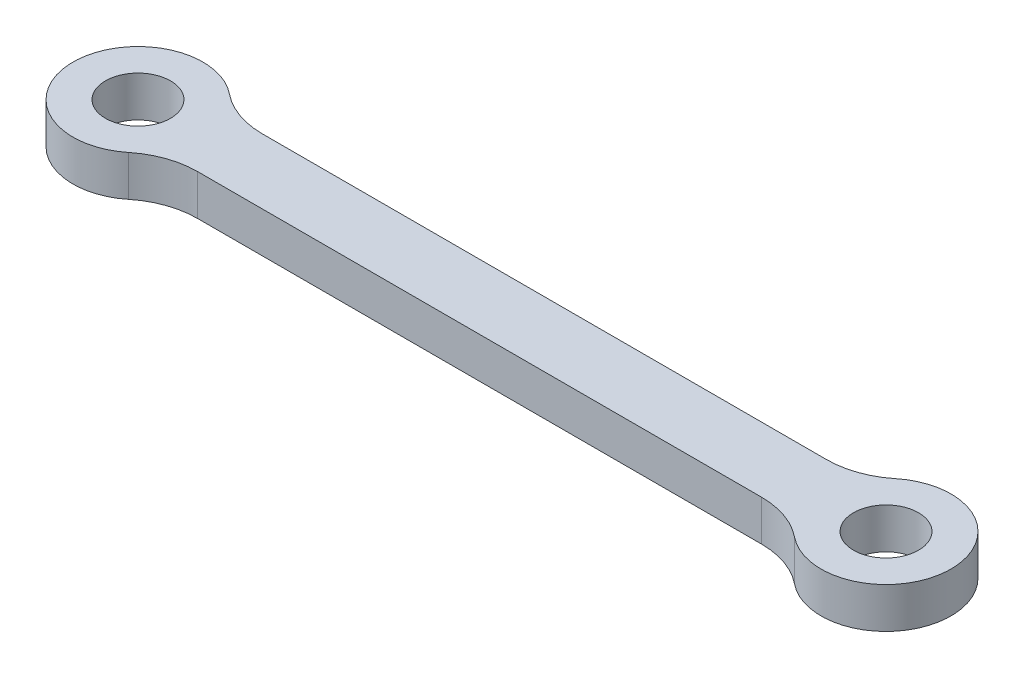
ISO-10303-21;
HEADER;
FILE_DESCRIPTION(('STEP AP214'),'2;1');
FILE_NAME('part.step','',(''),(''),'','','');
FILE_SCHEMA(('AUTOMOTIVE_DESIGN { 1 0 10303 214 1 1 1 1 }'));
ENDSEC;
DATA;
#1=APPLICATION_CONTEXT('core data for automotive mechanical design processes');
#2=APPLICATION_PROTOCOL_DEFINITION('international standard','automotive_design',2000,#1);
#3=PRODUCT_CONTEXT('',#1,'mechanical');
#4=PRODUCT('Part','Part','',(#3));
#5=PRODUCT_RELATED_PRODUCT_CATEGORY('part','',(#4));
#6=PRODUCT_DEFINITION_FORMATION('','',#4);
#7=PRODUCT_DEFINITION_CONTEXT('part definition',#1,'design');
#8=PRODUCT_DEFINITION('design','',#6,#7);
#9=PRODUCT_DEFINITION_SHAPE('','',#8);
#10=(LENGTH_UNIT() NAMED_UNIT(*) SI_UNIT(.MILLI.,.METRE.));
#11=(NAMED_UNIT(*) PLANE_ANGLE_UNIT() SI_UNIT($,.RADIAN.));
#12=(NAMED_UNIT(*) SI_UNIT($,.STERADIAN.) SOLID_ANGLE_UNIT());
#13=UNCERTAINTY_MEASURE_WITH_UNIT(LENGTH_MEASURE(1.E-05),#10,'distance_accuracy_value','');
#14=(GEOMETRIC_REPRESENTATION_CONTEXT(3) GLOBAL_UNCERTAINTY_ASSIGNED_CONTEXT((#13)) GLOBAL_UNIT_ASSIGNED_CONTEXT((#10,
#11,#12)) REPRESENTATION_CONTEXT('',''));
#15=CARTESIAN_POINT('',(0.,0.,0.));
#16=DIRECTION('',(0.,0.,1.));
#17=DIRECTION('',(1.,0.,0.));
#18=AXIS2_PLACEMENT_3D('',#15,#16,#17);
#19=CARTESIAN_POINT('',(-23.,3.75,0.));
#20=DIRECTION('',(0.,1.,0.));
#21=DIRECTION('',(0.,0.,1.));
#22=AXIS2_PLACEMENT_3D('',#19,#20,#21);
#23=PLANE('',#22);
#24=CARTESIAN_POINT('',(-23.,3.75,0.));
#25=DIRECTION('',(0.,1.,0.));
#26=DIRECTION('',(0.,0.,1.));
#27=AXIS2_PLACEMENT_3D('',#24,#25,#26);
#28=CIRCLE('',#27,2.);
#29=CARTESIAN_POINT('',(-23.,3.75,2.));
#30=VERTEX_POINT('',#29);
#31=EDGE_CURVE('E162',#30,#30,#28,.T.);
#32=ORIENTED_EDGE('',*,*,#31,.F.);
#33=EDGE_LOOP('',(#32));
#34=FACE_BOUND('',#33,.T.);
#35=DIRECTION('',(-1.,0.,0.));
#36=VECTOR('',#35,1.);
#37=CARTESIAN_POINT('',(19.5358983848622,3.75,-2.));
#38=LINE('',#37,#36);
#39=CARTESIAN_POINT('',(17.3431457505076,3.75,-2.));
#40=VERTEX_POINT('',#39);
#41=CARTESIAN_POINT('',(-17.3431457505076,3.75,-2.));
#42=VERTEX_POINT('',#41);
#43=EDGE_CURVE('E139',#40,#42,#38,.T.);
#44=ORIENTED_EDGE('',*,*,#43,.T.);
#45=CARTESIAN_POINT('',(-17.3431457505076,3.75,-7.));
#46=DIRECTION('',(0.,1.,0.));
#47=DIRECTION('',(0.,0.,1.));
#48=AXIS2_PLACEMENT_3D('',#45,#46,#47);
#49=CIRCLE('',#48,5.);
#50=CARTESIAN_POINT('',(-20.4858425557812,3.75,-3.11111111111111));
#51=VERTEX_POINT('',#50);
#52=EDGE_CURVE('E56',#42,#51,#49,.F.);
#53=ORIENTED_EDGE('',*,*,#52,.T.);
#54=CARTESIAN_POINT('',(-23.,3.75,0.));
#55=DIRECTION('',(0.,1.,0.));
#56=DIRECTION('',(0.,0.,1.));
#57=AXIS2_PLACEMENT_3D('',#54,#55,#56);
#58=CIRCLE('',#57,4.);
#59=CARTESIAN_POINT('',(-20.4858425557812,3.75,3.11111111111111));
#60=VERTEX_POINT('',#59);
#61=EDGE_CURVE('E133',#51,#60,#58,.T.);
#62=ORIENTED_EDGE('',*,*,#61,.T.);
#63=CARTESIAN_POINT('',(-17.3431457505076,3.75,7.));
#64=DIRECTION('',(0.,1.,0.));
#65=DIRECTION('',(0.,0.,1.));
#66=AXIS2_PLACEMENT_3D('',#63,#64,#65);
#67=CIRCLE('',#66,5.);
#68=CARTESIAN_POINT('',(-17.3431457505076,3.75,2.));
#69=VERTEX_POINT('',#68);
#70=EDGE_CURVE('E11',#60,#69,#67,.F.);
#71=ORIENTED_EDGE('',*,*,#70,.T.);
#72=DIRECTION('',(1.,0.,0.));
#73=VECTOR('',#72,1.);
#74=CARTESIAN_POINT('',(19.5358983848622,3.75,1.99999999999999));
#75=LINE('',#74,#73);
#76=CARTESIAN_POINT('',(17.3431457505076,3.75,1.99999999999999));
#77=VERTEX_POINT('',#76);
#78=EDGE_CURVE('E167',#69,#77,#75,.T.);
#79=ORIENTED_EDGE('',*,*,#78,.T.);
#80=CARTESIAN_POINT('',(17.3431457505076,3.75,6.99999999999999));
#81=DIRECTION('',(0.,1.,0.));
#82=DIRECTION('',(0.,0.,1.));
#83=AXIS2_PLACEMENT_3D('',#80,#81,#82);
#84=CIRCLE('',#83,5.);
#85=CARTESIAN_POINT('',(20.4858425557811,3.75,3.11111111111111));
#86=VERTEX_POINT('',#85);
#87=EDGE_CURVE('E110',#77,#86,#84,.F.);
#88=ORIENTED_EDGE('',*,*,#87,.T.);
#89=CARTESIAN_POINT('',(23.,3.75,0.));
#90=DIRECTION('',(0.,1.,0.));
#91=DIRECTION('',(0.,0.,-1.));
#92=AXIS2_PLACEMENT_3D('',#89,#90,#91);
#93=CIRCLE('',#92,4.);
#94=CARTESIAN_POINT('',(20.4858425557812,3.75,-3.11111111111111));
#95=VERTEX_POINT('',#94);
#96=EDGE_CURVE('E120',#86,#95,#93,.T.);
#97=ORIENTED_EDGE('',*,*,#96,.T.);
#98=CARTESIAN_POINT('',(17.3431457505076,3.75,-7.));
#99=DIRECTION('',(0.,1.,0.));
#100=DIRECTION('',(0.,0.,1.));
#101=AXIS2_PLACEMENT_3D('',#98,#99,#100);
#102=CIRCLE('',#101,5.);
#103=EDGE_CURVE('E154',#95,#40,#102,.F.);
#104=ORIENTED_EDGE('',*,*,#103,.T.);
#105=EDGE_LOOP('',(#44,#53,#62,#71,#79,#88,#97,#104));
#106=FACE_BOUND('',#105,.T.);
#107=CARTESIAN_POINT('',(23.,3.75,0.));
#108=DIRECTION('',(0.,1.,0.));
#109=DIRECTION('',(0.,0.,-1.));
#110=AXIS2_PLACEMENT_3D('',#107,#108,#109);
#111=CIRCLE('',#110,2.);
#112=CARTESIAN_POINT('',(23.,3.75,-2.));
#113=VERTEX_POINT('',#112);
#114=EDGE_CURVE('E288',#113,#113,#111,.T.);
#115=ORIENTED_EDGE('',*,*,#114,.F.);
#116=EDGE_LOOP('',(#115));
#117=FACE_BOUND('',#116,.T.);
#118=ADVANCED_FACE('F34',(#34,#106,#117),#23,.T.);
#119=CARTESIAN_POINT('',(-23.,1.25,0.));
#120=DIRECTION('',(0.,1.,0.));
#121=DIRECTION('',(0.,0.,1.));
#122=AXIS2_PLACEMENT_3D('',#119,#120,#121);
#123=PLANE('',#122);
#124=CARTESIAN_POINT('',(-23.,1.25,0.));
#125=DIRECTION('',(0.,1.,0.));
#126=DIRECTION('',(0.,0.,1.));
#127=AXIS2_PLACEMENT_3D('',#124,#125,#126);
#128=CIRCLE('',#127,4.);
#129=CARTESIAN_POINT('',(-20.4858425557812,1.25,-3.11111111111111));
#130=VERTEX_POINT('',#129);
#131=CARTESIAN_POINT('',(-20.4858425557812,1.25,3.11111111111111));
#132=VERTEX_POINT('',#131);
#133=EDGE_CURVE('E135',#130,#132,#128,.T.);
#134=ORIENTED_EDGE('',*,*,#133,.F.);
#135=CARTESIAN_POINT('',(-17.3431457505076,1.25,-7.));
#136=DIRECTION('',(0.,1.,0.));
#137=DIRECTION('',(0.,0.,1.));
#138=AXIS2_PLACEMENT_3D('',#135,#136,#137);
#139=CIRCLE('',#138,5.);
#140=CARTESIAN_POINT('',(-17.3431457505076,1.25,-2.));
#141=VERTEX_POINT('',#140);
#142=EDGE_CURVE('E156',#130,#141,#139,.T.);
#143=ORIENTED_EDGE('',*,*,#142,.T.);
#144=DIRECTION('',(-1.,0.,0.));
#145=VECTOR('',#144,1.);
#146=CARTESIAN_POINT('',(19.5358983848622,1.25,-2.));
#147=LINE('',#146,#145);
#148=CARTESIAN_POINT('',(17.3431457505076,1.25,-2.));
#149=VERTEX_POINT('',#148);
#150=EDGE_CURVE('E129',#149,#141,#147,.T.);
#151=ORIENTED_EDGE('',*,*,#150,.F.);
#152=CARTESIAN_POINT('',(17.3431457505076,1.25,-7.));
#153=DIRECTION('',(0.,1.,0.));
#154=DIRECTION('',(0.,0.,1.));
#155=AXIS2_PLACEMENT_3D('',#152,#153,#154);
#156=CIRCLE('',#155,5.);
#157=CARTESIAN_POINT('',(20.4858425557812,1.25,-3.11111111111111));
#158=VERTEX_POINT('',#157);
#159=EDGE_CURVE('E128',#149,#158,#156,.T.);
#160=ORIENTED_EDGE('',*,*,#159,.T.);
#161=CARTESIAN_POINT('',(23.,1.25,0.));
#162=DIRECTION('',(0.,1.,0.));
#163=DIRECTION('',(0.,0.,-1.));
#164=AXIS2_PLACEMENT_3D('',#161,#162,#163);
#165=CIRCLE('',#164,4.);
#166=CARTESIAN_POINT('',(20.4858425557811,1.25,3.11111111111111));
#167=VERTEX_POINT('',#166);
#168=EDGE_CURVE('E117',#167,#158,#165,.T.);
#169=ORIENTED_EDGE('',*,*,#168,.F.);
#170=CARTESIAN_POINT('',(17.3431457505076,1.25,6.99999999999999));
#171=DIRECTION('',(0.,1.,0.));
#172=DIRECTION('',(0.,0.,1.));
#173=AXIS2_PLACEMENT_3D('',#170,#171,#172);
#174=CIRCLE('',#173,5.);
#175=CARTESIAN_POINT('',(17.3431457505076,1.25,1.99999999999999));
#176=VERTEX_POINT('',#175);
#177=EDGE_CURVE('E100',#167,#176,#174,.T.);
#178=ORIENTED_EDGE('',*,*,#177,.T.);
#179=DIRECTION('',(1.,0.,0.));
#180=VECTOR('',#179,1.);
#181=CARTESIAN_POINT('',(19.5358983848622,1.25,1.99999999999999));
#182=LINE('',#181,#180);
#183=CARTESIAN_POINT('',(-17.3431457505076,1.25,2.));
#184=VERTEX_POINT('',#183);
#185=EDGE_CURVE('E130',#184,#176,#182,.T.);
#186=ORIENTED_EDGE('',*,*,#185,.F.);
#187=CARTESIAN_POINT('',(-17.3431457505076,1.25,7.));
#188=DIRECTION('',(0.,1.,0.));
#189=DIRECTION('',(0.,0.,1.));
#190=AXIS2_PLACEMENT_3D('',#187,#188,#189);
#191=CIRCLE('',#190,5.);
#192=EDGE_CURVE('E42',#184,#132,#191,.T.);
#193=ORIENTED_EDGE('',*,*,#192,.T.);
#194=EDGE_LOOP('',(#134,#143,#151,#160,#169,#178,#186,#193));
#195=FACE_BOUND('',#194,.T.);
#196=CARTESIAN_POINT('',(-23.,1.25,0.));
#197=DIRECTION('',(0.,1.,0.));
#198=DIRECTION('',(0.,0.,1.));
#199=AXIS2_PLACEMENT_3D('',#196,#197,#198);
#200=CIRCLE('',#199,2.);
#201=CARTESIAN_POINT('',(-23.,1.25,2.));
#202=VERTEX_POINT('',#201);
#203=EDGE_CURVE('E294',#202,#202,#200,.T.);
#204=ORIENTED_EDGE('',*,*,#203,.T.);
#205=EDGE_LOOP('',(#204));
#206=FACE_BOUND('',#205,.T.);
#207=CARTESIAN_POINT('',(23.,1.25,0.));
#208=DIRECTION('',(0.,1.,0.));
#209=DIRECTION('',(0.,0.,-1.));
#210=AXIS2_PLACEMENT_3D('',#207,#208,#209);
#211=CIRCLE('',#210,2.);
#212=CARTESIAN_POINT('',(23.,1.25,-2.));
#213=VERTEX_POINT('',#212);
#214=EDGE_CURVE('E291',#213,#213,#211,.T.);
#215=ORIENTED_EDGE('',*,*,#214,.T.);
#216=EDGE_LOOP('',(#215));
#217=FACE_BOUND('',#216,.T.);
#218=ADVANCED_FACE('F125',(#195,#206,#217),#123,.F.);
#219=CARTESIAN_POINT('',(-23.,3.75,0.));
#220=DIRECTION('',(0.,-1.,0.));
#221=DIRECTION('',(0.,0.,-1.));
#222=AXIS2_PLACEMENT_3D('',#219,#220,#221);
#223=CYLINDRICAL_SURFACE('',#222,4.);
#224=ORIENTED_EDGE('',*,*,#61,.F.);
#225=DIRECTION('',(0.,-1.,0.));
#226=VECTOR('',#225,1.);
#227=CARTESIAN_POINT('',(-20.4858425557812,3.75,-3.11111111111111));
#228=LINE('',#227,#226);
#229=EDGE_CURVE('E111',#51,#130,#228,.T.);
#230=ORIENTED_EDGE('',*,*,#229,.T.);
#231=ORIENTED_EDGE('',*,*,#133,.T.);
#232=DIRECTION('',(0.,-1.,0.));
#233=VECTOR('',#232,1.);
#234=CARTESIAN_POINT('',(-20.4858425557812,3.75,3.11111111111111));
#235=LINE('',#234,#233);
#236=EDGE_CURVE('E49',#132,#60,#235,.F.);
#237=ORIENTED_EDGE('',*,*,#236,.T.);
#238=EDGE_LOOP('',(#224,#230,#231,#237));
#239=FACE_BOUND('',#238,.T.);
#240=ADVANCED_FACE('F160',(#239),#223,.T.);
#241=CARTESIAN_POINT('',(19.5358983848622,3.75,1.99999999999999));
#242=DIRECTION('',(0.,0.,-1.));
#243=DIRECTION('',(-1.,0.,0.));
#244=AXIS2_PLACEMENT_3D('',#241,#242,#243);
#245=PLANE('',#244);
#246=ORIENTED_EDGE('',*,*,#185,.T.);
#247=DIRECTION('',(0.,1.,0.));
#248=VECTOR('',#247,1.);
#249=CARTESIAN_POINT('',(17.3431457505076,3.75,1.99999999999999));
#250=LINE('',#249,#248);
#251=EDGE_CURVE('E105',#176,#77,#250,.T.);
#252=ORIENTED_EDGE('',*,*,#251,.T.);
#253=ORIENTED_EDGE('',*,*,#78,.F.);
#254=DIRECTION('',(0.,1.,0.));
#255=VECTOR('',#254,1.);
#256=CARTESIAN_POINT('',(-17.3431457505076,1.25,2.));
#257=LINE('',#256,#255);
#258=EDGE_CURVE('E121',#69,#184,#257,.F.);
#259=ORIENTED_EDGE('',*,*,#258,.T.);
#260=EDGE_LOOP('',(#246,#252,#253,#259));
#261=FACE_BOUND('',#260,.T.);
#262=ADVANCED_FACE('F169',(#261),#245,.F.);
#263=CARTESIAN_POINT('',(23.,3.75,0.));
#264=DIRECTION('',(0.,-1.,0.));
#265=DIRECTION('',(0.,0.,-1.));
#266=AXIS2_PLACEMENT_3D('',#263,#264,#265);
#267=CYLINDRICAL_SURFACE('',#266,4.);
#268=ORIENTED_EDGE('',*,*,#96,.F.);
#269=DIRECTION('',(0.,-1.,0.));
#270=VECTOR('',#269,1.);
#271=CARTESIAN_POINT('',(20.4858425557811,3.75,3.11111111111111));
#272=LINE('',#271,#270);
#273=EDGE_CURVE('E104',#86,#167,#272,.T.);
#274=ORIENTED_EDGE('',*,*,#273,.T.);
#275=ORIENTED_EDGE('',*,*,#168,.T.);
#276=DIRECTION('',(0.,-1.,0.));
#277=VECTOR('',#276,1.);
#278=CARTESIAN_POINT('',(20.4858425557812,3.75,-3.11111111111111));
#279=LINE('',#278,#277);
#280=EDGE_CURVE('E122',#158,#95,#279,.F.);
#281=ORIENTED_EDGE('',*,*,#280,.T.);
#282=EDGE_LOOP('',(#268,#274,#275,#281));
#283=FACE_BOUND('',#282,.T.);
#284=ADVANCED_FACE('F116',(#283),#267,.T.);
#285=CARTESIAN_POINT('',(19.5358983848622,3.75,-2.));
#286=DIRECTION('',(0.,0.,1.));
#287=DIRECTION('',(1.,0.,0.));
#288=AXIS2_PLACEMENT_3D('',#285,#286,#287);
#289=PLANE('',#288);
#290=ORIENTED_EDGE('',*,*,#43,.F.);
#291=DIRECTION('',(0.,1.,0.));
#292=VECTOR('',#291,1.);
#293=CARTESIAN_POINT('',(17.3431457505076,1.25,-2.));
#294=LINE('',#293,#292);
#295=EDGE_CURVE('E146',#40,#149,#294,.F.);
#296=ORIENTED_EDGE('',*,*,#295,.T.);
#297=ORIENTED_EDGE('',*,*,#150,.T.);
#298=DIRECTION('',(0.,1.,0.));
#299=VECTOR('',#298,1.);
#300=CARTESIAN_POINT('',(-17.3431457505076,3.75,-2.));
#301=LINE('',#300,#299);
#302=EDGE_CURVE('E144',#141,#42,#301,.T.);
#303=ORIENTED_EDGE('',*,*,#302,.T.);
#304=EDGE_LOOP('',(#290,#296,#297,#303));
#305=FACE_BOUND('',#304,.T.);
#306=ADVANCED_FACE('F182',(#305),#289,.F.);
#307=CARTESIAN_POINT('',(-23.,3.75,0.));
#308=DIRECTION('',(0.,-1.,0.));
#309=DIRECTION('',(0.,0.,-1.));
#310=AXIS2_PLACEMENT_3D('',#307,#308,#309);
#311=CYLINDRICAL_SURFACE('',#310,2.);
#312=ORIENTED_EDGE('',*,*,#31,.T.);
#313=EDGE_LOOP('',(#312));
#314=FACE_BOUND('',#313,.T.);
#315=ORIENTED_EDGE('',*,*,#203,.F.);
#316=EDGE_LOOP('',(#315));
#317=FACE_BOUND('',#316,.T.);
#318=ADVANCED_FACE('F202',(#314,#317),#311,.F.);
#319=CARTESIAN_POINT('',(23.,3.75,0.));
#320=DIRECTION('',(0.,-1.,0.));
#321=DIRECTION('',(0.,0.,-1.));
#322=AXIS2_PLACEMENT_3D('',#319,#320,#321);
#323=CYLINDRICAL_SURFACE('',#322,2.);
#324=ORIENTED_EDGE('',*,*,#114,.T.);
#325=EDGE_LOOP('',(#324));
#326=FACE_BOUND('',#325,.T.);
#327=ORIENTED_EDGE('',*,*,#214,.F.);
#328=EDGE_LOOP('',(#327));
#329=FACE_BOUND('',#328,.T.);
#330=ADVANCED_FACE('F191',(#326,#329),#323,.F.);
#331=CARTESIAN_POINT('',(17.3431457505076,3.75,6.99999999999999));
#332=DIRECTION('',(0.,-1.,0.));
#333=DIRECTION('',(0.,0.,-1.));
#334=AXIS2_PLACEMENT_3D('',#331,#332,#333);
#335=CYLINDRICAL_SURFACE('',#334,5.);
#336=ORIENTED_EDGE('',*,*,#87,.F.);
#337=ORIENTED_EDGE('',*,*,#251,.F.);
#338=ORIENTED_EDGE('',*,*,#177,.F.);
#339=ORIENTED_EDGE('',*,*,#273,.F.);
#340=EDGE_LOOP('',(#336,#337,#338,#339));
#341=FACE_BOUND('',#340,.T.);
#342=ADVANCED_FACE('F103',(#341),#335,.F.);
#343=CARTESIAN_POINT('',(17.3431457505076,3.75,-7.));
#344=DIRECTION('',(0.,-1.,0.));
#345=DIRECTION('',(0.,0.,-1.));
#346=AXIS2_PLACEMENT_3D('',#343,#344,#345);
#347=CYLINDRICAL_SURFACE('',#346,5.);
#348=ORIENTED_EDGE('',*,*,#103,.F.);
#349=ORIENTED_EDGE('',*,*,#280,.F.);
#350=ORIENTED_EDGE('',*,*,#159,.F.);
#351=ORIENTED_EDGE('',*,*,#295,.F.);
#352=EDGE_LOOP('',(#348,#349,#350,#351));
#353=FACE_BOUND('',#352,.T.);
#354=ADVANCED_FACE('F184',(#353),#347,.F.);
#355=CARTESIAN_POINT('',(-17.3431457505076,3.75,-7.));
#356=DIRECTION('',(0.,-1.,0.));
#357=DIRECTION('',(0.,0.,-1.));
#358=AXIS2_PLACEMENT_3D('',#355,#356,#357);
#359=CYLINDRICAL_SURFACE('',#358,5.);
#360=ORIENTED_EDGE('',*,*,#52,.F.);
#361=ORIENTED_EDGE('',*,*,#302,.F.);
#362=ORIENTED_EDGE('',*,*,#142,.F.);
#363=ORIENTED_EDGE('',*,*,#229,.F.);
#364=EDGE_LOOP('',(#360,#361,#362,#363));
#365=FACE_BOUND('',#364,.T.);
#366=ADVANCED_FACE('F181',(#365),#359,.F.);
#367=CARTESIAN_POINT('',(-17.3431457505076,3.75,7.));
#368=DIRECTION('',(0.,-1.,0.));
#369=DIRECTION('',(0.,0.,-1.));
#370=AXIS2_PLACEMENT_3D('',#367,#368,#369);
#371=CYLINDRICAL_SURFACE('',#370,5.);
#372=ORIENTED_EDGE('',*,*,#70,.F.);
#373=ORIENTED_EDGE('',*,*,#236,.F.);
#374=ORIENTED_EDGE('',*,*,#192,.F.);
#375=ORIENTED_EDGE('',*,*,#258,.F.);
#376=EDGE_LOOP('',(#372,#373,#374,#375));
#377=FACE_BOUND('',#376,.T.);
#378=ADVANCED_FACE('F36',(#377),#371,.F.);
#379=CLOSED_SHELL('',(#118,#218,#240,#262,#284,#306,#318,#330,#342,#354,#366,#378));
#380=MANIFOLD_SOLID_BREP('B2',#379);
#381=ADVANCED_BREP_SHAPE_REPRESENTATION('',(#18,#380),#14);
#382=SHAPE_DEFINITION_REPRESENTATION(#9,#381);
ENDSEC;
END-ISO-10303-21;
